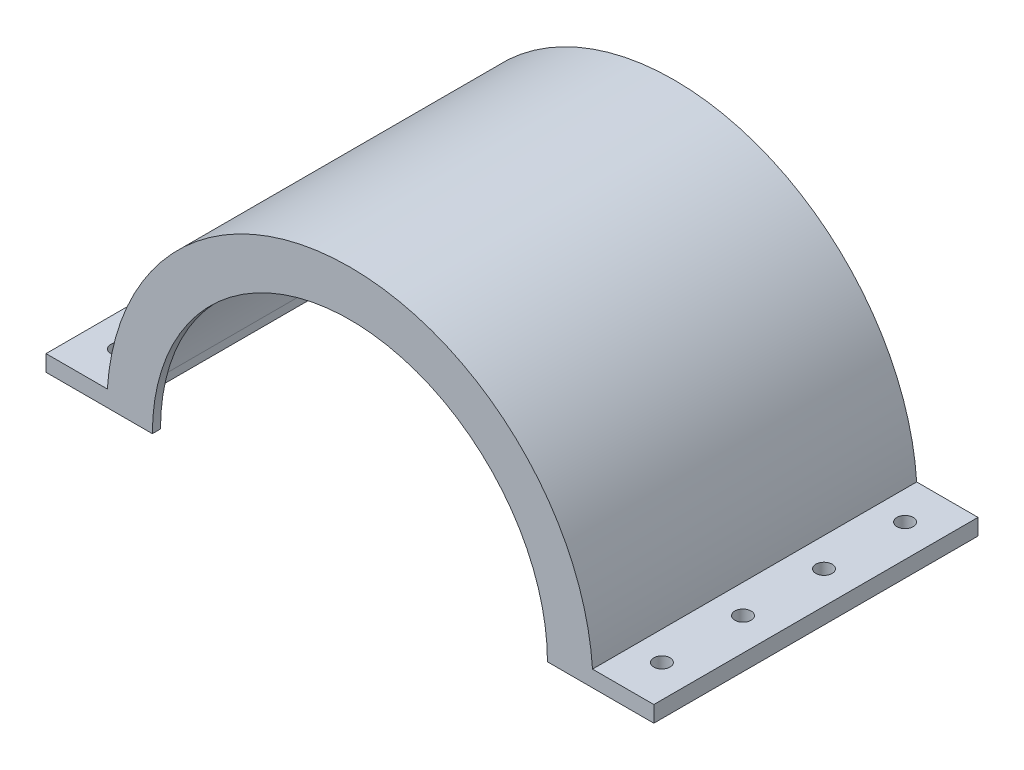
ISO-10303-21;
HEADER;
FILE_DESCRIPTION(('STEP AP214'),'2;1');
FILE_NAME('part.step','',(''),(''),'','','');
FILE_SCHEMA(('AUTOMOTIVE_DESIGN { 1 0 10303 214 1 1 1 1 }'));
ENDSEC;
DATA;
#1=APPLICATION_CONTEXT('core data for automotive mechanical design processes');
#2=APPLICATION_PROTOCOL_DEFINITION('international standard','automotive_design',2000,#1);
#3=PRODUCT_CONTEXT('',#1,'mechanical');
#4=PRODUCT('Part','Part','',(#3));
#5=PRODUCT_RELATED_PRODUCT_CATEGORY('part','',(#4));
#6=PRODUCT_DEFINITION_FORMATION('','',#4);
#7=PRODUCT_DEFINITION_CONTEXT('part definition',#1,'design');
#8=PRODUCT_DEFINITION('design','',#6,#7);
#9=PRODUCT_DEFINITION_SHAPE('','',#8);
#10=(LENGTH_UNIT() NAMED_UNIT(*) SI_UNIT(.MILLI.,.METRE.));
#11=(NAMED_UNIT(*) PLANE_ANGLE_UNIT() SI_UNIT($,.RADIAN.));
#12=(NAMED_UNIT(*) SI_UNIT($,.STERADIAN.) SOLID_ANGLE_UNIT());
#13=UNCERTAINTY_MEASURE_WITH_UNIT(LENGTH_MEASURE(1.E-05),#10,'distance_accuracy_value','');
#14=(GEOMETRIC_REPRESENTATION_CONTEXT(3) GLOBAL_UNCERTAINTY_ASSIGNED_CONTEXT((#13)) GLOBAL_UNIT_ASSIGNED_CONTEXT((#10,
#11,#12)) REPRESENTATION_CONTEXT('',''));
#15=CARTESIAN_POINT('',(0.,0.,0.));
#16=DIRECTION('',(0.,0.,1.));
#17=DIRECTION('',(1.,0.,0.));
#18=AXIS2_PLACEMENT_3D('',#15,#16,#17);
#19=CARTESIAN_POINT('',(-75.,0.,80.));
#20=DIRECTION('',(0.,1.,0.));
#21=DIRECTION('',(0.,0.,1.));
#22=AXIS2_PLACEMENT_3D('',#19,#20,#21);
#23=PLANE('',#22);
#24=CARTESIAN_POINT('',(-67.,0.,30.));
#25=DIRECTION('',(0.,1.,0.));
#26=DIRECTION('',(0.,0.,-1.));
#27=AXIS2_PLACEMENT_3D('',#24,#25,#26);
#28=CIRCLE('',#27,2.);
#29=CARTESIAN_POINT('',(-67.,0.,28.));
#30=VERTEX_POINT('',#29);
#31=EDGE_CURVE('E247',#30,#30,#28,.T.);
#32=ORIENTED_EDGE('',*,*,#31,.T.);
#33=EDGE_LOOP('',(#32));
#34=FACE_BOUND('',#33,.T.);
#35=CARTESIAN_POINT('',(-67.,0.,70.));
#36=DIRECTION('',(0.,1.,0.));
#37=DIRECTION('',(0.,0.,-1.));
#38=AXIS2_PLACEMENT_3D('',#35,#36,#37);
#39=CIRCLE('',#38,2.);
#40=CARTESIAN_POINT('',(-67.,0.,68.));
#41=VERTEX_POINT('',#40);
#42=EDGE_CURVE('E241',#41,#41,#39,.T.);
#43=ORIENTED_EDGE('',*,*,#42,.T.);
#44=EDGE_LOOP('',(#43));
#45=FACE_BOUND('',#44,.T.);
#46=DIRECTION('',(1.,0.,0.));
#47=VECTOR('',#46,1.);
#48=CARTESIAN_POINT('',(-75.,0.,0.));
#49=LINE('',#48,#47);
#50=CARTESIAN_POINT('',(-75.,0.,0.));
#51=VERTEX_POINT('',#50);
#52=CARTESIAN_POINT('',(-15.,0.,0.));
#53=VERTEX_POINT('',#52);
#54=EDGE_CURVE('E199',#51,#53,#49,.T.);
#55=ORIENTED_EDGE('',*,*,#54,.T.);
#56=DIRECTION('',(0.,0.,-1.));
#57=VECTOR('',#56,1.);
#58=CARTESIAN_POINT('',(-15.,0.,80.001));
#59=LINE('',#58,#57);
#60=CARTESIAN_POINT('',(-15.,0.,2.));
#61=VERTEX_POINT('',#60);
#62=EDGE_CURVE('E50',#61,#53,#59,.T.);
#63=ORIENTED_EDGE('',*,*,#62,.F.);
#64=DIRECTION('',(1.,0.,0.));
#65=VECTOR('',#64,1.);
#66=CARTESIAN_POINT('',(-75.,0.,2.));
#67=LINE('',#66,#65);
#68=CARTESIAN_POINT('',(-57.9655069847577,0.,2.));
#69=VERTEX_POINT('',#68);
#70=EDGE_CURVE('E155',#69,#61,#67,.T.);
#71=ORIENTED_EDGE('',*,*,#70,.F.);
#72=DIRECTION('',(0.,0.,-1.));
#73=VECTOR('',#72,1.);
#74=CARTESIAN_POINT('',(-57.9655069847577,0.,78.));
#75=LINE('',#74,#73);
#76=CARTESIAN_POINT('',(-57.9655069847577,0.,78.));
#77=VERTEX_POINT('',#76);
#78=EDGE_CURVE('E163',#77,#69,#75,.T.);
#79=ORIENTED_EDGE('',*,*,#78,.F.);
#80=DIRECTION('',(1.,0.,0.));
#81=VECTOR('',#80,1.);
#82=CARTESIAN_POINT('',(-75.,0.,78.));
#83=LINE('',#82,#81);
#84=CARTESIAN_POINT('',(-48.75,0.,78.));
#85=VERTEX_POINT('',#84);
#86=EDGE_CURVE('E173',#77,#85,#83,.T.);
#87=ORIENTED_EDGE('',*,*,#86,.T.);
#88=DIRECTION('',(0.,0.,1.));
#89=VECTOR('',#88,1.);
#90=CARTESIAN_POINT('',(-48.75,0.,-0.001000000000001));
#91=LINE('',#90,#89);
#92=CARTESIAN_POINT('',(-48.75,0.,80.));
#93=VERTEX_POINT('',#92);
#94=EDGE_CURVE('E270',#85,#93,#91,.T.);
#95=ORIENTED_EDGE('',*,*,#94,.T.);
#96=DIRECTION('',(1.,0.,0.));
#97=VECTOR('',#96,1.);
#98=CARTESIAN_POINT('',(-75.,0.,80.));
#99=LINE('',#98,#97);
#100=CARTESIAN_POINT('',(-75.,0.,80.));
#101=VERTEX_POINT('',#100);
#102=EDGE_CURVE('E183',#101,#93,#99,.T.);
#103=ORIENTED_EDGE('',*,*,#102,.F.);
#104=DIRECTION('',(0.,0.,-1.));
#105=VECTOR('',#104,1.);
#106=CARTESIAN_POINT('',(-75.,0.,80.));
#107=LINE('',#106,#105);
#108=EDGE_CURVE('E223',#101,#51,#107,.T.);
#109=ORIENTED_EDGE('',*,*,#108,.T.);
#110=EDGE_LOOP('',(#55,#63,#71,#79,#87,#95,#103,#109));
#111=FACE_BOUND('',#110,.T.);
#112=CARTESIAN_POINT('',(-67.,0.,50.));
#113=DIRECTION('',(0.,1.,0.));
#114=DIRECTION('',(0.,0.,-1.));
#115=AXIS2_PLACEMENT_3D('',#112,#113,#114);
#116=CIRCLE('',#115,2.);
#117=CARTESIAN_POINT('',(-67.,0.,48.));
#118=VERTEX_POINT('',#117);
#119=EDGE_CURVE('E244',#118,#118,#116,.T.);
#120=ORIENTED_EDGE('',*,*,#119,.T.);
#121=EDGE_LOOP('',(#120));
#122=FACE_BOUND('',#121,.T.);
#123=CARTESIAN_POINT('',(-67.,0.,10.));
#124=DIRECTION('',(0.,1.,0.));
#125=DIRECTION('',(0.,0.,-1.));
#126=AXIS2_PLACEMENT_3D('',#123,#124,#125);
#127=CIRCLE('',#126,2.);
#128=CARTESIAN_POINT('',(-67.,0.,8.00000000000001));
#129=VERTEX_POINT('',#128);
#130=EDGE_CURVE('E257',#129,#129,#127,.T.);
#131=ORIENTED_EDGE('',*,*,#130,.T.);
#132=EDGE_LOOP('',(#131));
#133=FACE_BOUND('',#132,.T.);
#134=ADVANCED_FACE('F33',(#34,#45,#111,#122,#133),#23,.F.);
#135=CARTESIAN_POINT('',(-75.,4.,80.));
#136=DIRECTION('',(0.,-1.,0.));
#137=DIRECTION('',(0.,0.,-1.));
#138=AXIS2_PLACEMENT_3D('',#135,#136,#137);
#139=PLANE('',#138);
#140=CARTESIAN_POINT('',(-67.,4.,30.));
#141=DIRECTION('',(0.,-1.,0.));
#142=DIRECTION('',(0.,0.,-1.));
#143=AXIS2_PLACEMENT_3D('',#140,#141,#142);
#144=CIRCLE('',#143,2.);
#145=CARTESIAN_POINT('',(-67.,4.,28.));
#146=VERTEX_POINT('',#145);
#147=EDGE_CURVE('E245',#146,#146,#144,.F.);
#148=ORIENTED_EDGE('',*,*,#147,.F.);
#149=EDGE_LOOP('',(#148));
#150=FACE_BOUND('',#149,.T.);
#151=CARTESIAN_POINT('',(-67.,4.,70.));
#152=DIRECTION('',(0.,-1.,0.));
#153=DIRECTION('',(0.,0.,-1.));
#154=AXIS2_PLACEMENT_3D('',#151,#152,#153);
#155=CIRCLE('',#154,2.);
#156=CARTESIAN_POINT('',(-67.,4.,68.));
#157=VERTEX_POINT('',#156);
#158=EDGE_CURVE('E237',#157,#157,#155,.F.);
#159=ORIENTED_EDGE('',*,*,#158,.F.);
#160=EDGE_LOOP('',(#159));
#161=FACE_BOUND('',#160,.T.);
#162=DIRECTION('',(-1.,0.,0.));
#163=VECTOR('',#162,1.);
#164=CARTESIAN_POINT('',(-75.,4.,0.));
#165=LINE('',#164,#163);
#166=CARTESIAN_POINT('',(-59.8665181883831,3.99999999999999,0.));
#167=VERTEX_POINT('',#166);
#168=CARTESIAN_POINT('',(-75.,4.,0.));
#169=VERTEX_POINT('',#168);
#170=EDGE_CURVE('E182',#167,#169,#165,.T.);
#171=ORIENTED_EDGE('',*,*,#170,.T.);
#172=DIRECTION('',(0.,0.,-1.));
#173=VECTOR('',#172,1.);
#174=CARTESIAN_POINT('',(-75.,4.,80.));
#175=LINE('',#174,#173);
#176=CARTESIAN_POINT('',(-75.,4.,80.));
#177=VERTEX_POINT('',#176);
#178=EDGE_CURVE('E194',#177,#169,#175,.T.);
#179=ORIENTED_EDGE('',*,*,#178,.F.);
#180=DIRECTION('',(-1.,0.,0.));
#181=VECTOR('',#180,1.);
#182=CARTESIAN_POINT('',(-75.,4.,80.));
#183=LINE('',#182,#181);
#184=CARTESIAN_POINT('',(-59.8665181883831,3.99999999999999,80.));
#185=VERTEX_POINT('',#184);
#186=EDGE_CURVE('E192',#185,#177,#183,.T.);
#187=ORIENTED_EDGE('',*,*,#186,.F.);
#188=DIRECTION('',(0.,0.,-1.));
#189=VECTOR('',#188,1.);
#190=CARTESIAN_POINT('',(-59.8665181883831,3.99999999999999,80.));
#191=LINE('',#190,#189);
#192=EDGE_CURVE('E211',#185,#167,#191,.T.);
#193=ORIENTED_EDGE('',*,*,#192,.T.);
#194=EDGE_LOOP('',(#171,#179,#187,#193));
#195=FACE_BOUND('',#194,.T.);
#196=CARTESIAN_POINT('',(-67.,4.,50.));
#197=DIRECTION('',(0.,-1.,0.));
#198=DIRECTION('',(0.,0.,-1.));
#199=AXIS2_PLACEMENT_3D('',#196,#197,#198);
#200=CIRCLE('',#199,2.);
#201=CARTESIAN_POINT('',(-67.,4.,48.));
#202=VERTEX_POINT('',#201);
#203=EDGE_CURVE('E242',#202,#202,#200,.F.);
#204=ORIENTED_EDGE('',*,*,#203,.F.);
#205=EDGE_LOOP('',(#204));
#206=FACE_BOUND('',#205,.T.);
#207=CARTESIAN_POINT('',(-67.,4.,10.));
#208=DIRECTION('',(0.,-1.,0.));
#209=DIRECTION('',(0.,0.,-1.));
#210=AXIS2_PLACEMENT_3D('',#207,#208,#209);
#211=CIRCLE('',#210,2.);
#212=CARTESIAN_POINT('',(-67.,4.,8.00000000000001));
#213=VERTEX_POINT('',#212);
#214=EDGE_CURVE('E37',#213,#213,#211,.F.);
#215=ORIENTED_EDGE('',*,*,#214,.F.);
#216=EDGE_LOOP('',(#215));
#217=FACE_BOUND('',#216,.T.);
#218=ADVANCED_FACE('F332',(#150,#161,#195,#206,#217),#139,.F.);
#219=CARTESIAN_POINT('',(67.,0.,50.));
#220=DIRECTION('',(0.,-1.,0.));
#221=DIRECTION('',(0.,0.,-1.));
#222=AXIS2_PLACEMENT_3D('',#219,#220,#221);
#223=CIRCLE('',#222,2.);
#224=CARTESIAN_POINT('',(67.,0.,48.));
#225=VERTEX_POINT('',#224);
#226=EDGE_CURVE('E240',#225,#225,#223,.T.);
#227=ORIENTED_EDGE('',*,*,#226,.F.);
#228=EDGE_LOOP('',(#227));
#229=FACE_BOUND('',#228,.T.);
#230=CARTESIAN_POINT('',(67.,0.,70.));
#231=DIRECTION('',(0.,-1.,0.));
#232=DIRECTION('',(0.,0.,-1.));
#233=AXIS2_PLACEMENT_3D('',#230,#231,#232);
#234=CIRCLE('',#233,2.);
#235=CARTESIAN_POINT('',(67.,0.,68.));
#236=VERTEX_POINT('',#235);
#237=EDGE_CURVE('E229',#236,#236,#234,.T.);
#238=ORIENTED_EDGE('',*,*,#237,.F.);
#239=EDGE_LOOP('',(#238));
#240=FACE_BOUND('',#239,.T.);
#241=CARTESIAN_POINT('',(15.,0.,2.));
#242=VERTEX_POINT('',#241);
#243=CARTESIAN_POINT('',(57.9123339376508,0.,2.));
#244=VERTEX_POINT('',#243);
#245=EDGE_CURVE('E152',#242,#244,#67,.T.);
#246=ORIENTED_EDGE('',*,*,#245,.F.);
#247=DIRECTION('',(0.,0.,-1.));
#248=VECTOR('',#247,1.);
#249=CARTESIAN_POINT('',(15.,0.,80.001));
#250=LINE('',#249,#248);
#251=CARTESIAN_POINT('',(15.,0.,0.));
#252=VERTEX_POINT('',#251);
#253=EDGE_CURVE('E140',#242,#252,#250,.T.);
#254=ORIENTED_EDGE('',*,*,#253,.T.);
#255=CARTESIAN_POINT('',(75.,0.,0.));
#256=VERTEX_POINT('',#255);
#257=EDGE_CURVE('E198',#252,#256,#49,.T.);
#258=ORIENTED_EDGE('',*,*,#257,.T.);
#259=DIRECTION('',(0.,0.,-1.));
#260=VECTOR('',#259,1.);
#261=CARTESIAN_POINT('',(75.,0.,80.));
#262=LINE('',#261,#260);
#263=CARTESIAN_POINT('',(75.,0.,80.));
#264=VERTEX_POINT('',#263);
#265=EDGE_CURVE('E220',#264,#256,#262,.T.);
#266=ORIENTED_EDGE('',*,*,#265,.F.);
#267=CARTESIAN_POINT('',(48.75,0.,80.));
#268=VERTEX_POINT('',#267);
#269=EDGE_CURVE('E181',#268,#264,#99,.T.);
#270=ORIENTED_EDGE('',*,*,#269,.F.);
#271=DIRECTION('',(0.,0.,1.));
#272=VECTOR('',#271,1.);
#273=CARTESIAN_POINT('',(48.75,0.,-0.001000000000001));
#274=LINE('',#273,#272);
#275=CARTESIAN_POINT('',(48.75,0.,78.));
#276=VERTEX_POINT('',#275);
#277=EDGE_CURVE('E58',#276,#268,#274,.T.);
#278=ORIENTED_EDGE('',*,*,#277,.F.);
#279=CARTESIAN_POINT('',(57.9123339376508,0.,78.));
#280=VERTEX_POINT('',#279);
#281=EDGE_CURVE('E177',#276,#280,#83,.T.);
#282=ORIENTED_EDGE('',*,*,#281,.T.);
#283=DIRECTION('',(0.,0.,1.));
#284=VECTOR('',#283,1.);
#285=CARTESIAN_POINT('',(57.9123339376508,0.,78.));
#286=LINE('',#285,#284);
#287=EDGE_CURVE('E161',#244,#280,#286,.T.);
#288=ORIENTED_EDGE('',*,*,#287,.F.);
#289=EDGE_LOOP('',(#246,#254,#258,#266,#270,#278,#282,#288));
#290=FACE_BOUND('',#289,.T.);
#291=CARTESIAN_POINT('',(67.,0.,30.));
#292=DIRECTION('',(0.,-1.,0.));
#293=DIRECTION('',(0.,0.,-1.));
#294=AXIS2_PLACEMENT_3D('',#291,#292,#293);
#295=CIRCLE('',#294,2.);
#296=CARTESIAN_POINT('',(67.,0.,28.));
#297=VERTEX_POINT('',#296);
#298=EDGE_CURVE('E226',#297,#297,#295,.T.);
#299=ORIENTED_EDGE('',*,*,#298,.F.);
#300=EDGE_LOOP('',(#299));
#301=FACE_BOUND('',#300,.T.);
#302=CARTESIAN_POINT('',(67.,0.,10.));
#303=DIRECTION('',(0.,-1.,0.));
#304=DIRECTION('',(0.,0.,-1.));
#305=AXIS2_PLACEMENT_3D('',#302,#303,#304);
#306=CIRCLE('',#305,2.);
#307=CARTESIAN_POINT('',(67.,0.,8.00000000000001));
#308=VERTEX_POINT('',#307);
#309=EDGE_CURVE('E42',#308,#308,#306,.T.);
#310=ORIENTED_EDGE('',*,*,#309,.F.);
#311=EDGE_LOOP('',(#310));
#312=FACE_BOUND('',#311,.T.);
#313=ADVANCED_FACE('F158',(#229,#240,#290,#301,#312),#23,.F.);
#314=CARTESIAN_POINT('',(0.,0.,78.));
#315=DIRECTION('',(0.,0.,1.));
#316=DIRECTION('',(1.,0.,0.));
#317=AXIS2_PLACEMENT_3D('',#314,#315,#316);
#318=PLANE('',#317);
#319=ORIENTED_EDGE('',*,*,#281,.F.);
#320=CARTESIAN_POINT('',(0.,0.,78.));
#321=DIRECTION('',(0.,0.,1.));
#322=DIRECTION('',(1.,0.,0.));
#323=AXIS2_PLACEMENT_3D('',#320,#321,#322);
#324=CIRCLE('',#323,48.75);
#325=EDGE_CURVE('E274',#85,#276,#324,.F.);
#326=ORIENTED_EDGE('',*,*,#325,.F.);
#327=ORIENTED_EDGE('',*,*,#86,.F.);
#328=DIRECTION('',(0.,1.,0.));
#329=VECTOR('',#328,1.);
#330=CARTESIAN_POINT('',(-57.9655069847577,-77.4831444070836,78.));
#331=LINE('',#330,#329);
#332=CARTESIAN_POINT('',(-57.9655069847577,2.,78.));
#333=VERTEX_POINT('',#332);
#334=EDGE_CURVE('E281',#77,#333,#331,.T.);
#335=ORIENTED_EDGE('',*,*,#334,.T.);
#336=CARTESIAN_POINT('',(0.,0.,78.));
#337=DIRECTION('',(0.,0.,1.));
#338=DIRECTION('',(1.,0.,0.));
#339=AXIS2_PLACEMENT_3D('',#336,#337,#338);
#340=CIRCLE('',#339,58.);
#341=CARTESIAN_POINT('',(57.9655069847577,2.,78.));
#342=VERTEX_POINT('',#341);
#343=EDGE_CURVE('E176',#342,#333,#340,.T.);
#344=ORIENTED_EDGE('',*,*,#343,.F.);
#345=DIRECTION('',(-1.,0.,0.));
#346=VECTOR('',#345,1.);
#347=CARTESIAN_POINT('',(57.9123339376508,2.,78.));
#348=LINE('',#347,#346);
#349=CARTESIAN_POINT('',(57.9123339376508,2.,78.));
#350=VERTEX_POINT('',#349);
#351=EDGE_CURVE('E288',#342,#350,#348,.T.);
#352=ORIENTED_EDGE('',*,*,#351,.T.);
#353=DIRECTION('',(0.,1.,0.));
#354=VECTOR('',#353,1.);
#355=CARTESIAN_POINT('',(57.9123339376508,-77.4831444070836,78.));
#356=LINE('',#355,#354);
#357=EDGE_CURVE('E290',#280,#350,#356,.T.);
#358=ORIENTED_EDGE('',*,*,#357,.F.);
#359=EDGE_LOOP('',(#319,#326,#327,#335,#344,#352,#358));
#360=FACE_BOUND('',#359,.T.);
#361=ADVANCED_FACE('F318',(#360),#318,.F.);
#362=CARTESIAN_POINT('',(0.,0.,2.));
#363=DIRECTION('',(0.,0.,1.));
#364=DIRECTION('',(1.,0.,0.));
#365=AXIS2_PLACEMENT_3D('',#362,#363,#364);
#366=PLANE('',#365);
#367=CARTESIAN_POINT('',(0.,0.,2.));
#368=DIRECTION('',(0.,0.,1.));
#369=DIRECTION('',(1.,0.,0.));
#370=AXIS2_PLACEMENT_3D('',#367,#368,#369);
#371=CIRCLE('',#370,15.);
#372=EDGE_CURVE('E143',#61,#242,#371,.F.);
#373=ORIENTED_EDGE('',*,*,#372,.T.);
#374=ORIENTED_EDGE('',*,*,#245,.T.);
#375=DIRECTION('',(0.,1.,0.));
#376=VECTOR('',#375,1.);
#377=CARTESIAN_POINT('',(57.9123339376508,-77.4831444070836,2.));
#378=LINE('',#377,#376);
#379=CARTESIAN_POINT('',(57.9123339376508,2.,2.));
#380=VERTEX_POINT('',#379);
#381=EDGE_CURVE('E282',#244,#380,#378,.T.);
#382=ORIENTED_EDGE('',*,*,#381,.T.);
#383=DIRECTION('',(1.,0.,0.));
#384=VECTOR('',#383,1.);
#385=CARTESIAN_POINT('',(57.9123339376508,2.,2.));
#386=LINE('',#385,#384);
#387=CARTESIAN_POINT('',(57.9655069847577,2.,2.));
#388=VERTEX_POINT('',#387);
#389=EDGE_CURVE('E285',#380,#388,#386,.T.);
#390=ORIENTED_EDGE('',*,*,#389,.T.);
#391=CARTESIAN_POINT('',(0.,0.,2.));
#392=DIRECTION('',(0.,0.,1.));
#393=DIRECTION('',(1.,0.,0.));
#394=AXIS2_PLACEMENT_3D('',#391,#392,#393);
#395=CIRCLE('',#394,58.);
#396=CARTESIAN_POINT('',(-57.9655069847577,2.,2.));
#397=VERTEX_POINT('',#396);
#398=EDGE_CURVE('E165',#388,#397,#395,.T.);
#399=ORIENTED_EDGE('',*,*,#398,.T.);
#400=DIRECTION('',(0.,1.,0.));
#401=VECTOR('',#400,1.);
#402=CARTESIAN_POINT('',(-57.9655069847577,-77.4831444070836,2.));
#403=LINE('',#402,#401);
#404=EDGE_CURVE('E167',#69,#397,#403,.T.);
#405=ORIENTED_EDGE('',*,*,#404,.F.);
#406=ORIENTED_EDGE('',*,*,#70,.T.);
#407=EDGE_LOOP('',(#373,#374,#382,#390,#399,#405,#406));
#408=FACE_BOUND('',#407,.T.);
#409=ADVANCED_FACE('F151',(#408),#366,.T.);
#410=CARTESIAN_POINT('',(-75.,0.,80.));
#411=DIRECTION('',(1.,0.,0.));
#412=DIRECTION('',(0.,0.,-1.));
#413=AXIS2_PLACEMENT_3D('',#410,#411,#412);
#414=PLANE('',#413);
#415=DIRECTION('',(0.,-1.,0.));
#416=VECTOR('',#415,1.);
#417=CARTESIAN_POINT('',(-75.,0.,0.));
#418=LINE('',#417,#416);
#419=EDGE_CURVE('E195',#169,#51,#418,.T.);
#420=ORIENTED_EDGE('',*,*,#419,.T.);
#421=ORIENTED_EDGE('',*,*,#108,.F.);
#422=DIRECTION('',(0.,-1.,0.));
#423=VECTOR('',#422,1.);
#424=CARTESIAN_POINT('',(-75.,0.,80.));
#425=LINE('',#424,#423);
#426=EDGE_CURVE('E178',#177,#101,#425,.T.);
#427=ORIENTED_EDGE('',*,*,#426,.F.);
#428=ORIENTED_EDGE('',*,*,#178,.T.);
#429=EDGE_LOOP('',(#420,#421,#427,#428));
#430=FACE_BOUND('',#429,.T.);
#431=ADVANCED_FACE('F393',(#430),#414,.F.);
#432=CARTESIAN_POINT('',(75.,0.,80.));
#433=DIRECTION('',(-1.,0.,0.));
#434=DIRECTION('',(0.,0.,1.));
#435=AXIS2_PLACEMENT_3D('',#432,#433,#434);
#436=PLANE('',#435);
#437=DIRECTION('',(0.,1.,0.));
#438=VECTOR('',#437,1.);
#439=CARTESIAN_POINT('',(75.,0.,0.));
#440=LINE('',#439,#438);
#441=CARTESIAN_POINT('',(75.,4.,0.));
#442=VERTEX_POINT('',#441);
#443=EDGE_CURVE('E202',#256,#442,#440,.T.);
#444=ORIENTED_EDGE('',*,*,#443,.T.);
#445=DIRECTION('',(0.,0.,-1.));
#446=VECTOR('',#445,1.);
#447=CARTESIAN_POINT('',(75.,4.,80.));
#448=LINE('',#447,#446);
#449=CARTESIAN_POINT('',(75.,4.,80.));
#450=VERTEX_POINT('',#449);
#451=EDGE_CURVE('E217',#450,#442,#448,.T.);
#452=ORIENTED_EDGE('',*,*,#451,.F.);
#453=DIRECTION('',(0.,1.,0.));
#454=VECTOR('',#453,1.);
#455=CARTESIAN_POINT('',(75.,0.,80.));
#456=LINE('',#455,#454);
#457=EDGE_CURVE('E186',#264,#450,#456,.T.);
#458=ORIENTED_EDGE('',*,*,#457,.F.);
#459=ORIENTED_EDGE('',*,*,#265,.T.);
#460=EDGE_LOOP('',(#444,#452,#458,#459));
#461=FACE_BOUND('',#460,.T.);
#462=ADVANCED_FACE('F363',(#461),#436,.F.);
#463=CARTESIAN_POINT('',(75.,4.,80.));
#464=DIRECTION('',(0.,-1.,0.));
#465=DIRECTION('',(0.,0.,-1.));
#466=AXIS2_PLACEMENT_3D('',#463,#464,#465);
#467=PLANE('',#466);
#468=CARTESIAN_POINT('',(67.,4.,50.));
#469=DIRECTION('',(0.,-1.,0.));
#470=DIRECTION('',(0.,0.,-1.));
#471=AXIS2_PLACEMENT_3D('',#468,#469,#470);
#472=CIRCLE('',#471,2.);
#473=CARTESIAN_POINT('',(67.,4.,48.));
#474=VERTEX_POINT('',#473);
#475=EDGE_CURVE('E264',#474,#474,#472,.T.);
#476=ORIENTED_EDGE('',*,*,#475,.T.);
#477=EDGE_LOOP('',(#476));
#478=FACE_BOUND('',#477,.T.);
#479=CARTESIAN_POINT('',(67.,4.,70.));
#480=DIRECTION('',(0.,-1.,0.));
#481=DIRECTION('',(0.,0.,-1.));
#482=AXIS2_PLACEMENT_3D('',#479,#480,#481);
#483=CIRCLE('',#482,2.);
#484=CARTESIAN_POINT('',(67.,4.,68.));
#485=VERTEX_POINT('',#484);
#486=EDGE_CURVE('E156',#485,#485,#483,.T.);
#487=ORIENTED_EDGE('',*,*,#486,.T.);
#488=EDGE_LOOP('',(#487));
#489=FACE_BOUND('',#488,.T.);
#490=DIRECTION('',(-1.,0.,0.));
#491=VECTOR('',#490,1.);
#492=CARTESIAN_POINT('',(75.,4.,0.));
#493=LINE('',#492,#491);
#494=CARTESIAN_POINT('',(59.8665181883831,4.,0.));
#495=VERTEX_POINT('',#494);
#496=EDGE_CURVE('E204',#442,#495,#493,.T.);
#497=ORIENTED_EDGE('',*,*,#496,.T.);
#498=DIRECTION('',(0.,0.,-1.));
#499=VECTOR('',#498,1.);
#500=CARTESIAN_POINT('',(59.8665181883831,4.,80.));
#501=LINE('',#500,#499);
#502=CARTESIAN_POINT('',(59.8665181883831,4.,80.));
#503=VERTEX_POINT('',#502);
#504=EDGE_CURVE('E214',#503,#495,#501,.T.);
#505=ORIENTED_EDGE('',*,*,#504,.F.);
#506=DIRECTION('',(-1.,0.,0.));
#507=VECTOR('',#506,1.);
#508=CARTESIAN_POINT('',(75.,4.,80.));
#509=LINE('',#508,#507);
#510=EDGE_CURVE('E188',#450,#503,#509,.T.);
#511=ORIENTED_EDGE('',*,*,#510,.F.);
#512=ORIENTED_EDGE('',*,*,#451,.T.);
#513=EDGE_LOOP('',(#497,#505,#511,#512));
#514=FACE_BOUND('',#513,.T.);
#515=CARTESIAN_POINT('',(67.,4.,30.));
#516=DIRECTION('',(0.,-1.,0.));
#517=DIRECTION('',(0.,0.,-1.));
#518=AXIS2_PLACEMENT_3D('',#515,#516,#517);
#519=CIRCLE('',#518,2.);
#520=CARTESIAN_POINT('',(67.,4.,28.));
#521=VERTEX_POINT('',#520);
#522=EDGE_CURVE('E232',#521,#521,#519,.T.);
#523=ORIENTED_EDGE('',*,*,#522,.T.);
#524=EDGE_LOOP('',(#523));
#525=FACE_BOUND('',#524,.T.);
#526=CARTESIAN_POINT('',(67.,4.,10.));
#527=DIRECTION('',(0.,-1.,0.));
#528=DIRECTION('',(0.,0.,-1.));
#529=AXIS2_PLACEMENT_3D('',#526,#527,#528);
#530=CIRCLE('',#529,2.);
#531=CARTESIAN_POINT('',(67.,4.,8.00000000000001));
#532=VERTEX_POINT('',#531);
#533=EDGE_CURVE('E11',#532,#532,#530,.T.);
#534=ORIENTED_EDGE('',*,*,#533,.T.);
#535=EDGE_LOOP('',(#534));
#536=FACE_BOUND('',#535,.T.);
#537=ADVANCED_FACE('F359',(#478,#489,#514,#525,#536),#467,.F.);
#538=CARTESIAN_POINT('',(0.,0.,80.));
#539=DIRECTION('',(0.,0.,-1.));
#540=DIRECTION('',(-1.,0.,0.));
#541=AXIS2_PLACEMENT_3D('',#538,#539,#540);
#542=CYLINDRICAL_SURFACE('',#541,60.);
#543=CARTESIAN_POINT('',(0.,0.,0.));
#544=DIRECTION('',(0.,0.,1.));
#545=DIRECTION('',(1.,0.,0.));
#546=AXIS2_PLACEMENT_3D('',#543,#544,#545);
#547=CIRCLE('',#546,60.);
#548=EDGE_CURVE('E206',#495,#167,#547,.T.);
#549=ORIENTED_EDGE('',*,*,#548,.T.);
#550=ORIENTED_EDGE('',*,*,#192,.F.);
#551=CARTESIAN_POINT('',(0.,0.,80.));
#552=DIRECTION('',(0.,0.,1.));
#553=DIRECTION('',(1.,0.,0.));
#554=AXIS2_PLACEMENT_3D('',#551,#552,#553);
#555=CIRCLE('',#554,60.);
#556=EDGE_CURVE('E190',#503,#185,#555,.T.);
#557=ORIENTED_EDGE('',*,*,#556,.F.);
#558=ORIENTED_EDGE('',*,*,#504,.T.);
#559=EDGE_LOOP('',(#549,#550,#557,#558));
#560=FACE_BOUND('',#559,.T.);
#561=ADVANCED_FACE('F362',(#560),#542,.T.);
#562=CARTESIAN_POINT('',(0.,0.,80.));
#563=DIRECTION('',(0.,0.,1.));
#564=DIRECTION('',(1.,0.,0.));
#565=AXIS2_PLACEMENT_3D('',#562,#563,#564);
#566=PLANE('',#565);
#567=CARTESIAN_POINT('',(0.,0.,80.));
#568=DIRECTION('',(0.,0.,1.));
#569=DIRECTION('',(1.,0.,0.));
#570=AXIS2_PLACEMENT_3D('',#567,#568,#569);
#571=CIRCLE('',#570,48.75);
#572=EDGE_CURVE('E272',#268,#93,#571,.T.);
#573=ORIENTED_EDGE('',*,*,#572,.F.);
#574=ORIENTED_EDGE('',*,*,#269,.T.);
#575=ORIENTED_EDGE('',*,*,#457,.T.);
#576=ORIENTED_EDGE('',*,*,#510,.T.);
#577=ORIENTED_EDGE('',*,*,#556,.T.);
#578=ORIENTED_EDGE('',*,*,#186,.T.);
#579=ORIENTED_EDGE('',*,*,#426,.T.);
#580=ORIENTED_EDGE('',*,*,#102,.T.);
#581=EDGE_LOOP('',(#573,#574,#575,#576,#577,#578,#579,#580));
#582=FACE_BOUND('',#581,.T.);
#583=ADVANCED_FACE('F413',(#582),#566,.T.);
#584=CARTESIAN_POINT('',(0.,0.,0.));
#585=DIRECTION('',(0.,0.,1.));
#586=DIRECTION('',(1.,0.,0.));
#587=AXIS2_PLACEMENT_3D('',#584,#585,#586);
#588=PLANE('',#587);
#589=ORIENTED_EDGE('',*,*,#257,.F.);
#590=CARTESIAN_POINT('',(0.,0.,0.));
#591=DIRECTION('',(0.,0.,-1.));
#592=DIRECTION('',(-1.,0.,0.));
#593=AXIS2_PLACEMENT_3D('',#590,#591,#592);
#594=CIRCLE('',#593,15.);
#595=EDGE_CURVE('E144',#53,#252,#594,.T.);
#596=ORIENTED_EDGE('',*,*,#595,.F.);
#597=ORIENTED_EDGE('',*,*,#54,.F.);
#598=ORIENTED_EDGE('',*,*,#419,.F.);
#599=ORIENTED_EDGE('',*,*,#170,.F.);
#600=ORIENTED_EDGE('',*,*,#548,.F.);
#601=ORIENTED_EDGE('',*,*,#496,.F.);
#602=ORIENTED_EDGE('',*,*,#443,.F.);
#603=EDGE_LOOP('',(#589,#596,#597,#598,#599,#600,#601,#602));
#604=FACE_BOUND('',#603,.T.);
#605=ADVANCED_FACE('F408',(#604),#588,.F.);
#606=CARTESIAN_POINT('',(0.,0.,80.));
#607=DIRECTION('',(0.,0.,-1.));
#608=DIRECTION('',(-1.,0.,0.));
#609=AXIS2_PLACEMENT_3D('',#606,#607,#608);
#610=CYLINDRICAL_SURFACE('',#609,58.);
#611=ORIENTED_EDGE('',*,*,#398,.F.);
#612=DIRECTION('',(0.,0.,-1.));
#613=VECTOR('',#612,1.);
#614=CARTESIAN_POINT('',(57.9655069847577,2.,78.));
#615=LINE('',#614,#613);
#616=EDGE_CURVE('E171',#342,#388,#615,.T.);
#617=ORIENTED_EDGE('',*,*,#616,.F.);
#618=ORIENTED_EDGE('',*,*,#343,.T.);
#619=DIRECTION('',(0.,0.,-1.));
#620=VECTOR('',#619,1.);
#621=CARTESIAN_POINT('',(-57.9655069847577,2.,78.));
#622=LINE('',#621,#620);
#623=EDGE_CURVE('E297',#333,#397,#622,.T.);
#624=ORIENTED_EDGE('',*,*,#623,.T.);
#625=EDGE_LOOP('',(#611,#617,#618,#624));
#626=FACE_BOUND('',#625,.T.);
#627=ADVANCED_FACE('F304',(#626),#610,.F.);
#628=CARTESIAN_POINT('',(-57.9655069847577,-77.4831444070836,78.));
#629=DIRECTION('',(-1.,0.,0.));
#630=DIRECTION('',(0.,0.,1.));
#631=AXIS2_PLACEMENT_3D('',#628,#629,#630);
#632=PLANE('',#631);
#633=ORIENTED_EDGE('',*,*,#334,.F.);
#634=ORIENTED_EDGE('',*,*,#78,.T.);
#635=ORIENTED_EDGE('',*,*,#404,.T.);
#636=ORIENTED_EDGE('',*,*,#623,.F.);
#637=EDGE_LOOP('',(#633,#634,#635,#636));
#638=FACE_BOUND('',#637,.T.);
#639=ADVANCED_FACE('F310',(#638),#632,.F.);
#640=CARTESIAN_POINT('',(57.9123339376508,2.,2.));
#641=DIRECTION('',(0.,-1.,0.));
#642=DIRECTION('',(0.,0.,-1.));
#643=AXIS2_PLACEMENT_3D('',#640,#641,#642);
#644=PLANE('',#643);
#645=ORIENTED_EDGE('',*,*,#616,.T.);
#646=ORIENTED_EDGE('',*,*,#389,.F.);
#647=DIRECTION('',(0.,0.,-1.));
#648=VECTOR('',#647,1.);
#649=CARTESIAN_POINT('',(57.9123339376508,2.,78.));
#650=LINE('',#649,#648);
#651=EDGE_CURVE('E276',#350,#380,#650,.T.);
#652=ORIENTED_EDGE('',*,*,#651,.F.);
#653=ORIENTED_EDGE('',*,*,#351,.F.);
#654=EDGE_LOOP('',(#645,#646,#652,#653));
#655=FACE_BOUND('',#654,.T.);
#656=ADVANCED_FACE('F315',(#655),#644,.F.);
#657=CARTESIAN_POINT('',(57.9123339376508,-77.4831444070836,78.));
#658=DIRECTION('',(1.,0.,0.));
#659=DIRECTION('',(0.,0.,-1.));
#660=AXIS2_PLACEMENT_3D('',#657,#658,#659);
#661=PLANE('',#660);
#662=ORIENTED_EDGE('',*,*,#381,.F.);
#663=ORIENTED_EDGE('',*,*,#287,.T.);
#664=ORIENTED_EDGE('',*,*,#357,.T.);
#665=ORIENTED_EDGE('',*,*,#651,.T.);
#666=EDGE_LOOP('',(#662,#663,#664,#665));
#667=FACE_BOUND('',#666,.T.);
#668=ADVANCED_FACE('F320',(#667),#661,.F.);
#669=CARTESIAN_POINT('',(0.,0.,-0.001000000000001));
#670=DIRECTION('',(0.,0.,1.));
#671=DIRECTION('',(1.,0.,0.));
#672=AXIS2_PLACEMENT_3D('',#669,#670,#671);
#673=CYLINDRICAL_SURFACE('',#672,48.75);
#674=ORIENTED_EDGE('',*,*,#325,.T.);
#675=ORIENTED_EDGE('',*,*,#277,.T.);
#676=ORIENTED_EDGE('',*,*,#572,.T.);
#677=ORIENTED_EDGE('',*,*,#94,.F.);
#678=EDGE_LOOP('',(#674,#675,#676,#677));
#679=FACE_BOUND('',#678,.T.);
#680=ADVANCED_FACE('F322',(#679),#673,.F.);
#681=CARTESIAN_POINT('',(0.,0.,80.001));
#682=DIRECTION('',(0.,0.,-1.));
#683=DIRECTION('',(-1.,0.,0.));
#684=AXIS2_PLACEMENT_3D('',#681,#682,#683);
#685=CYLINDRICAL_SURFACE('',#684,15.);
#686=ORIENTED_EDGE('',*,*,#62,.T.);
#687=ORIENTED_EDGE('',*,*,#595,.T.);
#688=ORIENTED_EDGE('',*,*,#253,.F.);
#689=ORIENTED_EDGE('',*,*,#372,.F.);
#690=EDGE_LOOP('',(#686,#687,#688,#689));
#691=FACE_BOUND('',#690,.T.);
#692=ADVANCED_FACE('F142',(#691),#685,.F.);
#693=CARTESIAN_POINT('',(67.,60.,70.));
#694=DIRECTION('',(0.,-1.,0.));
#695=DIRECTION('',(0.,0.,-1.));
#696=AXIS2_PLACEMENT_3D('',#693,#694,#695);
#697=CYLINDRICAL_SURFACE('',#696,2.);
#698=ORIENTED_EDGE('',*,*,#237,.T.);
#699=EDGE_LOOP('',(#698));
#700=FACE_BOUND('',#699,.T.);
#701=ORIENTED_EDGE('',*,*,#486,.F.);
#702=EDGE_LOOP('',(#701));
#703=FACE_BOUND('',#702,.T.);
#704=ADVANCED_FACE('F352',(#700,#703),#697,.F.);
#705=CARTESIAN_POINT('',(67.,60.,50.));
#706=DIRECTION('',(0.,-1.,0.));
#707=DIRECTION('',(0.,0.,-1.));
#708=AXIS2_PLACEMENT_3D('',#705,#706,#707);
#709=CYLINDRICAL_SURFACE('',#708,2.);
#710=ORIENTED_EDGE('',*,*,#226,.T.);
#711=EDGE_LOOP('',(#710));
#712=FACE_BOUND('',#711,.T.);
#713=ORIENTED_EDGE('',*,*,#475,.F.);
#714=EDGE_LOOP('',(#713));
#715=FACE_BOUND('',#714,.T.);
#716=ADVANCED_FACE('F355',(#712,#715),#709,.F.);
#717=CARTESIAN_POINT('',(67.,60.,30.));
#718=DIRECTION('',(0.,-1.,0.));
#719=DIRECTION('',(0.,0.,-1.));
#720=AXIS2_PLACEMENT_3D('',#717,#718,#719);
#721=CYLINDRICAL_SURFACE('',#720,2.);
#722=ORIENTED_EDGE('',*,*,#298,.T.);
#723=EDGE_LOOP('',(#722));
#724=FACE_BOUND('',#723,.T.);
#725=ORIENTED_EDGE('',*,*,#522,.F.);
#726=EDGE_LOOP('',(#725));
#727=FACE_BOUND('',#726,.T.);
#728=ADVANCED_FACE('F375',(#724,#727),#721,.F.);
#729=CARTESIAN_POINT('',(67.,60.,10.));
#730=DIRECTION('',(0.,-1.,0.));
#731=DIRECTION('',(0.,0.,-1.));
#732=AXIS2_PLACEMENT_3D('',#729,#730,#731);
#733=CYLINDRICAL_SURFACE('',#732,2.);
#734=ORIENTED_EDGE('',*,*,#309,.T.);
#735=EDGE_LOOP('',(#734));
#736=FACE_BOUND('',#735,.T.);
#737=ORIENTED_EDGE('',*,*,#533,.F.);
#738=EDGE_LOOP('',(#737));
#739=FACE_BOUND('',#738,.T.);
#740=ADVANCED_FACE('F35',(#736,#739),#733,.F.);
#741=CARTESIAN_POINT('',(-67.,60.,70.));
#742=DIRECTION('',(0.,-1.,0.));
#743=DIRECTION('',(0.,0.,-1.));
#744=AXIS2_PLACEMENT_3D('',#741,#742,#743);
#745=CYLINDRICAL_SURFACE('',#744,2.);
#746=ORIENTED_EDGE('',*,*,#42,.F.);
#747=EDGE_LOOP('',(#746));
#748=FACE_BOUND('',#747,.T.);
#749=ORIENTED_EDGE('',*,*,#158,.T.);
#750=EDGE_LOOP('',(#749));
#751=FACE_BOUND('',#750,.T.);
#752=ADVANCED_FACE('F374',(#748,#751),#745,.F.);
#753=CARTESIAN_POINT('',(-67.,60.,50.));
#754=DIRECTION('',(0.,-1.,0.));
#755=DIRECTION('',(0.,0.,-1.));
#756=AXIS2_PLACEMENT_3D('',#753,#754,#755);
#757=CYLINDRICAL_SURFACE('',#756,2.);
#758=ORIENTED_EDGE('',*,*,#119,.F.);
#759=EDGE_LOOP('',(#758));
#760=FACE_BOUND('',#759,.T.);
#761=ORIENTED_EDGE('',*,*,#203,.T.);
#762=EDGE_LOOP('',(#761));
#763=FACE_BOUND('',#762,.T.);
#764=ADVANCED_FACE('F381',(#760,#763),#757,.F.);
#765=CARTESIAN_POINT('',(-67.,60.,30.));
#766=DIRECTION('',(0.,-1.,0.));
#767=DIRECTION('',(0.,0.,-1.));
#768=AXIS2_PLACEMENT_3D('',#765,#766,#767);
#769=CYLINDRICAL_SURFACE('',#768,2.);
#770=ORIENTED_EDGE('',*,*,#31,.F.);
#771=EDGE_LOOP('',(#770));
#772=FACE_BOUND('',#771,.T.);
#773=ORIENTED_EDGE('',*,*,#147,.T.);
#774=EDGE_LOOP('',(#773));
#775=FACE_BOUND('',#774,.T.);
#776=ADVANCED_FACE('F550',(#772,#775),#769,.F.);
#777=CARTESIAN_POINT('',(-67.,60.,10.));
#778=DIRECTION('',(0.,-1.,0.));
#779=DIRECTION('',(0.,0.,-1.));
#780=AXIS2_PLACEMENT_3D('',#777,#778,#779);
#781=CYLINDRICAL_SURFACE('',#780,2.);
#782=ORIENTED_EDGE('',*,*,#130,.F.);
#783=EDGE_LOOP('',(#782));
#784=FACE_BOUND('',#783,.T.);
#785=ORIENTED_EDGE('',*,*,#214,.T.);
#786=EDGE_LOOP('',(#785));
#787=FACE_BOUND('',#786,.T.);
#788=ADVANCED_FACE('F560',(#784,#787),#781,.F.);
#789=CLOSED_SHELL('',(#134,#218,#313,#361,#409,#431,#462,#537,#561,#583,#605,#627,#639,#656,
#668,#680,#692,#704,#716,#728,#740,#752,#764,#776,#788));
#790=MANIFOLD_SOLID_BREP('B2',#789);
#791=ADVANCED_BREP_SHAPE_REPRESENTATION('',(#18,#790),#14);
#792=SHAPE_DEFINITION_REPRESENTATION(#9,#791);
ENDSEC;
END-ISO-10303-21;
